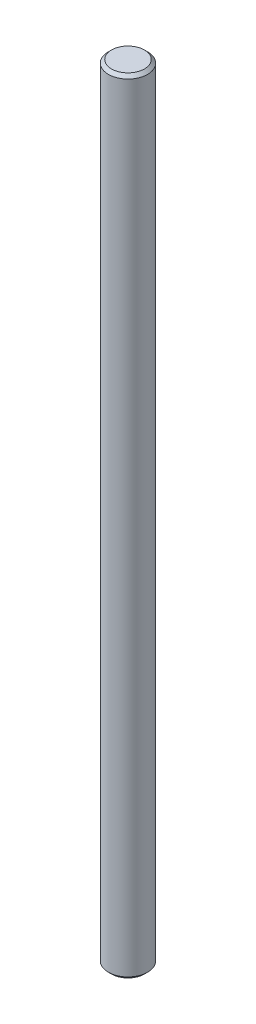
ISO-10303-21;
HEADER;
FILE_DESCRIPTION(('STEP AP214'),'2;1');
FILE_NAME('part.step','',(''),(''),'','','');
FILE_SCHEMA(('AUTOMOTIVE_DESIGN { 1 0 10303 214 1 1 1 1 }'));
ENDSEC;
DATA;
#1=APPLICATION_CONTEXT('core data for automotive mechanical design processes');
#2=APPLICATION_PROTOCOL_DEFINITION('international standard','automotive_design',2000,#1);
#3=PRODUCT_CONTEXT('',#1,'mechanical');
#4=PRODUCT('Part','Part','',(#3));
#5=PRODUCT_RELATED_PRODUCT_CATEGORY('part','',(#4));
#6=PRODUCT_DEFINITION_FORMATION('','',#4);
#7=PRODUCT_DEFINITION_CONTEXT('part definition',#1,'design');
#8=PRODUCT_DEFINITION('design','',#6,#7);
#9=PRODUCT_DEFINITION_SHAPE('','',#8);
#10=(LENGTH_UNIT() NAMED_UNIT(*) SI_UNIT(.MILLI.,.METRE.));
#11=(NAMED_UNIT(*) PLANE_ANGLE_UNIT() SI_UNIT($,.RADIAN.));
#12=(NAMED_UNIT(*) SI_UNIT($,.STERADIAN.) SOLID_ANGLE_UNIT());
#13=UNCERTAINTY_MEASURE_WITH_UNIT(LENGTH_MEASURE(1.E-05),#10,'distance_accuracy_value','');
#14=(GEOMETRIC_REPRESENTATION_CONTEXT(3) GLOBAL_UNCERTAINTY_ASSIGNED_CONTEXT((#13)) GLOBAL_UNIT_ASSIGNED_CONTEXT((#10,
#11,#12)) REPRESENTATION_CONTEXT('',''));
#15=CARTESIAN_POINT('',(0.,0.,0.));
#16=DIRECTION('',(0.,0.,1.));
#17=DIRECTION('',(1.,0.,0.));
#18=AXIS2_PLACEMENT_3D('',#15,#16,#17);
#19=CARTESIAN_POINT('',(0.,100.,0.));
#20=DIRECTION('',(0.,-1.,0.));
#21=DIRECTION('',(0.,0.,-1.));
#22=AXIS2_PLACEMENT_3D('',#19,#20,#21);
#23=CYLINDRICAL_SURFACE('',#22,2.5);
#24=CARTESIAN_POINT('',(0.,0.400000000000011,0.));
#25=DIRECTION('',(0.,1.,0.));
#26=DIRECTION('',(0.,0.,1.));
#27=AXIS2_PLACEMENT_3D('',#24,#25,#26);
#28=CIRCLE('',#27,2.5);
#29=CARTESIAN_POINT('',(0.,0.400000000000011,2.5));
#30=VERTEX_POINT('',#29);
#31=EDGE_CURVE('E40',#30,#30,#28,.T.);
#32=ORIENTED_EDGE('',*,*,#31,.T.);
#33=EDGE_LOOP('',(#32));
#34=FACE_BOUND('',#33,.T.);
#35=CARTESIAN_POINT('',(0.,99.6,0.));
#36=DIRECTION('',(0.,1.,0.));
#37=DIRECTION('',(0.,0.,1.));
#38=AXIS2_PLACEMENT_3D('',#35,#36,#37);
#39=CIRCLE('',#38,2.5);
#40=CARTESIAN_POINT('',(0.,99.6,2.5));
#41=VERTEX_POINT('',#40);
#42=EDGE_CURVE('E44',#41,#41,#39,.F.);
#43=ORIENTED_EDGE('',*,*,#42,.T.);
#44=EDGE_LOOP('',(#43));
#45=FACE_BOUND('',#44,.T.);
#46=ADVANCED_FACE('F30',(#34,#45),#23,.T.);
#47=CARTESIAN_POINT('',(0.,100.,0.));
#48=DIRECTION('',(0.,1.,0.));
#49=DIRECTION('',(0.,0.,1.));
#50=AXIS2_PLACEMENT_3D('',#47,#48,#49);
#51=PLANE('',#50);
#52=CARTESIAN_POINT('',(0.,100.,0.));
#53=DIRECTION('',(0.,1.,0.));
#54=DIRECTION('',(0.,0.,1.));
#55=AXIS2_PLACEMENT_3D('',#52,#53,#54);
#56=CIRCLE('',#55,2.09999999999999);
#57=CARTESIAN_POINT('',(0.,100.,2.09999999999999));
#58=VERTEX_POINT('',#57);
#59=EDGE_CURVE('E10',#58,#58,#56,.T.);
#60=ORIENTED_EDGE('',*,*,#59,.T.);
#61=EDGE_LOOP('',(#60));
#62=FACE_BOUND('',#61,.T.);
#63=ADVANCED_FACE('F63',(#62),#51,.T.);
#64=CARTESIAN_POINT('',(0.,0.,0.));
#65=DIRECTION('',(0.,1.,0.));
#66=DIRECTION('',(0.,0.,1.));
#67=AXIS2_PLACEMENT_3D('',#64,#65,#66);
#68=PLANE('',#67);
#69=CARTESIAN_POINT('',(0.,0.,0.));
#70=DIRECTION('',(0.,1.,0.));
#71=DIRECTION('',(0.,0.,1.));
#72=AXIS2_PLACEMENT_3D('',#69,#70,#71);
#73=CIRCLE('',#72,2.09999999999999);
#74=CARTESIAN_POINT('',(0.,0.,2.09999999999999));
#75=VERTEX_POINT('',#74);
#76=EDGE_CURVE('E36',#75,#75,#73,.F.);
#77=ORIENTED_EDGE('',*,*,#76,.T.);
#78=EDGE_LOOP('',(#77));
#79=FACE_BOUND('',#78,.T.);
#80=ADVANCED_FACE('F59',(#79),#68,.F.);
#81=CARTESIAN_POINT('',(0.,0.400000000000011,0.));
#82=DIRECTION('',(0.,1.,0.));
#83=DIRECTION('',(0.,0.,1.));
#84=AXIS2_PLACEMENT_3D('',#81,#82,#83);
#85=CONICAL_SURFACE('',#84,2.5,0.785398163397444);
#86=ORIENTED_EDGE('',*,*,#76,.F.);
#87=EDGE_LOOP('',(#86));
#88=FACE_BOUND('',#87,.T.);
#89=ORIENTED_EDGE('',*,*,#31,.F.);
#90=EDGE_LOOP('',(#89));
#91=FACE_BOUND('',#90,.T.);
#92=ADVANCED_FACE('F54',(#88,#91),#85,.T.);
#93=CARTESIAN_POINT('',(0.,100.,0.));
#94=DIRECTION('',(0.,-1.,0.));
#95=DIRECTION('',(0.,0.,-1.));
#96=AXIS2_PLACEMENT_3D('',#93,#94,#95);
#97=CONICAL_SURFACE('',#96,2.09999999999999,0.785398163397444);
#98=ORIENTED_EDGE('',*,*,#42,.F.);
#99=EDGE_LOOP('',(#98));
#100=FACE_BOUND('',#99,.T.);
#101=ORIENTED_EDGE('',*,*,#59,.F.);
#102=EDGE_LOOP('',(#101));
#103=FACE_BOUND('',#102,.T.);
#104=ADVANCED_FACE('F51',(#100,#103),#97,.T.);
#105=CLOSED_SHELL('',(#46,#63,#80,#92,#104));
#106=MANIFOLD_SOLID_BREP('B2',#105);
#107=ADVANCED_BREP_SHAPE_REPRESENTATION('',(#18,#106),#14);
#108=SHAPE_DEFINITION_REPRESENTATION(#9,#107);
ENDSEC;
END-ISO-10303-21;
